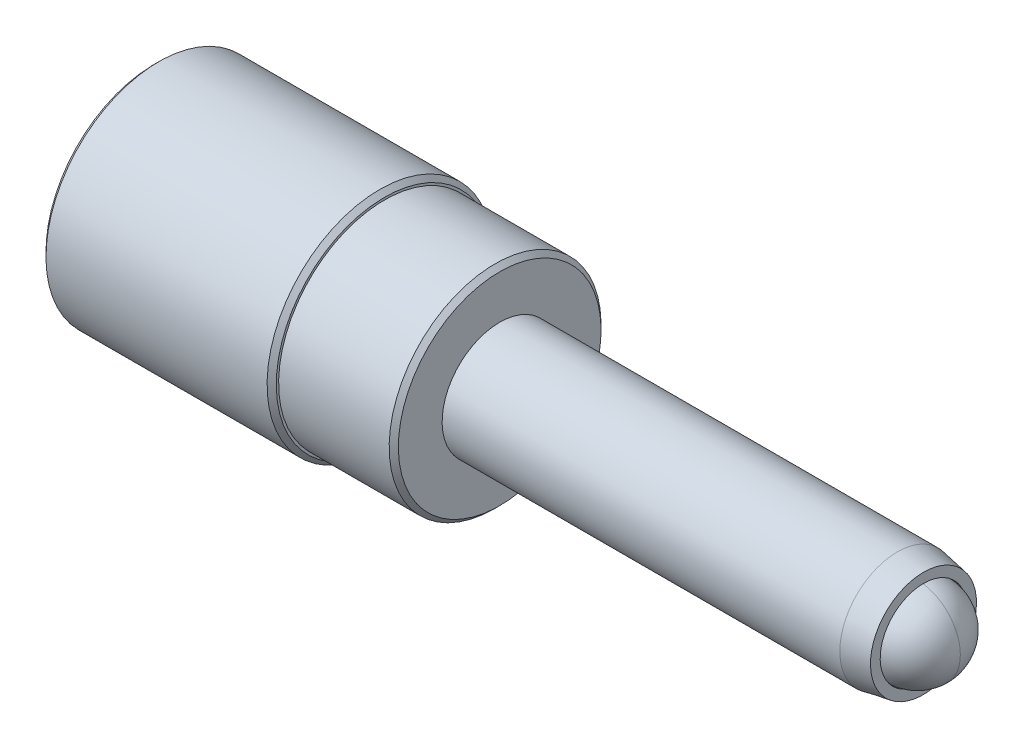
ISO-10303-21;
HEADER;
FILE_DESCRIPTION(('STEP AP214'),'2;1');
FILE_NAME('part.step','',(''),(''),'','','');
FILE_SCHEMA(('AUTOMOTIVE_DESIGN { 1 0 10303 214 1 1 1 1 }'));
ENDSEC;
DATA;
#1=APPLICATION_CONTEXT('core data for automotive mechanical design processes');
#2=APPLICATION_PROTOCOL_DEFINITION('international standard','automotive_design',2000,#1);
#3=PRODUCT_CONTEXT('',#1,'mechanical');
#4=PRODUCT('Part','Part','',(#3));
#5=PRODUCT_RELATED_PRODUCT_CATEGORY('part','',(#4));
#6=PRODUCT_DEFINITION_FORMATION('','',#4);
#7=PRODUCT_DEFINITION_CONTEXT('part definition',#1,'design');
#8=PRODUCT_DEFINITION('design','',#6,#7);
#9=PRODUCT_DEFINITION_SHAPE('','',#8);
#10=(LENGTH_UNIT() NAMED_UNIT(*) SI_UNIT(.MILLI.,.METRE.));
#11=(NAMED_UNIT(*) PLANE_ANGLE_UNIT() SI_UNIT($,.RADIAN.));
#12=(NAMED_UNIT(*) SI_UNIT($,.STERADIAN.) SOLID_ANGLE_UNIT());
#13=UNCERTAINTY_MEASURE_WITH_UNIT(LENGTH_MEASURE(1.E-05),#10,'distance_accuracy_value','');
#14=(GEOMETRIC_REPRESENTATION_CONTEXT(3) GLOBAL_UNCERTAINTY_ASSIGNED_CONTEXT((#13)) GLOBAL_UNIT_ASSIGNED_CONTEXT((#10,
#11,#12)) REPRESENTATION_CONTEXT('',''));
#15=CARTESIAN_POINT('',(0.,0.,0.));
#16=DIRECTION('',(0.,0.,1.));
#17=DIRECTION('',(1.,0.,0.));
#18=AXIS2_PLACEMENT_3D('',#15,#16,#17);
#19=CARTESIAN_POINT('',(-21.246795063286,1.19237132949041,-6.190904680416));
#20=DIRECTION('',(-0.898555667364288,0.394252384271372,0.192776477153873));
#21=DIRECTION('',(-0.186978583481269,-0.741325509164933,0.644573889310365));
#22=AXIS2_PLACEMENT_3D('',#19,#20,#21);
#23=SPHERICAL_SURFACE('',#22,1.190625);
#24=CARTESIAN_POINT('',(-22.3166379047416,1.66177807451351,-5.96138018730467));
#25=VERTEX_POINT('',#24);
#26=VERTEX_LOOP('',#25);
#27=FACE_BOUND('',#26,.T.);
#28=ADVANCED_FACE('P0_F13',(#27),#23,.T.);
#29=CLOSED_SHELL('',(#28));
#30=MANIFOLD_SOLID_BREP('P0_B1',#29);
#31=CARTESIAN_POINT('',(-16.087420063286,1.58320286749358,-2.10278836630096));
#32=DIRECTION('',(-1.,0.,0.));
#33=DIRECTION('',(0.,-1.,0.));
#34=AXIS2_PLACEMENT_3D('',#31,#32,#33);
#35=PLANE('',#34);
#36=CARTESIAN_POINT('',(-16.087420063286,1.58320286749358,-2.10278836630096));
#37=DIRECTION('',(1.,0.,0.));
#38=DIRECTION('',(0.,1.,0.));
#39=AXIS2_PLACEMENT_3D('',#36,#37,#38);
#40=CIRCLE('',#39,2.921);
#41=CARTESIAN_POINT('',(-16.087420063286,4.50420286749358,-2.10278836630096));
#42=VERTEX_POINT('',#41);
#43=EDGE_CURVE('P1_E11',#42,#42,#40,.T.);
#44=ORIENTED_EDGE('',*,*,#43,.F.);
#45=EDGE_LOOP('',(#44));
#46=FACE_BOUND('',#45,.T.);
#47=ADVANCED_FACE('P1_F17',(#46),#35,.T.);
#48=CARTESIAN_POINT('',(-15.833420063286,1.58320286749358,-2.10278836630096));
#49=DIRECTION('',(1.,0.,0.));
#50=DIRECTION('',(0.,1.,0.));
#51=AXIS2_PLACEMENT_3D('',#48,#49,#50);
#52=CONICAL_SURFACE('',#51,3.175,0.785398163397453);
#53=ORIENTED_EDGE('',*,*,#43,.T.);
#54=EDGE_LOOP('',(#53));
#55=FACE_BOUND('',#54,.T.);
#56=CARTESIAN_POINT('',(-15.833420063286,1.58320286749358,-2.10278836630096));
#57=DIRECTION('',(1.,0.,0.));
#58=DIRECTION('',(0.,1.,0.));
#59=AXIS2_PLACEMENT_3D('',#56,#57,#58);
#60=CIRCLE('',#59,3.175);
#61=CARTESIAN_POINT('',(-15.833420063286,4.75820286749359,-2.10278836630096));
#62=VERTEX_POINT('',#61);
#63=EDGE_CURVE('P1_E23',#62,#62,#60,.T.);
#64=ORIENTED_EDGE('',*,*,#63,.F.);
#65=EDGE_LOOP('',(#64));
#66=FACE_BOUND('',#65,.T.);
#67=ADVANCED_FACE('P1_F40',(#55,#66),#52,.T.);
#68=CARTESIAN_POINT('',(16.2637338913131,1.58320286749359,-2.10278836630096));
#69=DIRECTION('',(1.,0.,0.));
#70=DIRECTION('',(0.,1.,0.));
#71=AXIS2_PLACEMENT_3D('',#68,#69,#70);
#72=CYLINDRICAL_SURFACE('',#71,3.175);
#73=ORIENTED_EDGE('',*,*,#63,.T.);
#74=EDGE_LOOP('',(#73));
#75=FACE_BOUND('',#74,.T.);
#76=CARTESIAN_POINT('',(18.5400743545311,1.58320286749359,-2.10278836630096));
#77=DIRECTION('',(1.,0.,0.));
#78=DIRECTION('',(0.,1.,0.));
#79=AXIS2_PLACEMENT_3D('',#76,#77,#78);
#80=CIRCLE('',#79,3.175);
#81=CARTESIAN_POINT('',(18.5400743545311,4.75820286749359,-2.10278836630096));
#82=VERTEX_POINT('',#81);
#83=EDGE_CURVE('P1_E52',#82,#82,#80,.T.);
#84=ORIENTED_EDGE('',*,*,#83,.F.);
#85=EDGE_LOOP('',(#84));
#86=FACE_BOUND('',#85,.T.);
#87=ADVANCED_FACE('P1_F45',(#75,#86),#72,.T.);
#88=CARTESIAN_POINT('',(19.980579936714,1.58320286749359,-2.10278836630096));
#89=DIRECTION('',(-1.,0.,0.));
#90=DIRECTION('',(0.,-1.,0.));
#91=AXIS2_PLACEMENT_3D('',#88,#89,#90);
#92=CONICAL_SURFACE('',#91,2.921,0.174532925199434);
#93=ORIENTED_EDGE('',*,*,#83,.T.);
#94=EDGE_LOOP('',(#93));
#95=FACE_BOUND('',#94,.T.);
#96=CARTESIAN_POINT('',(19.980579936714,1.58320286749359,-2.10278836630096));
#97=DIRECTION('',(1.,0.,0.));
#98=DIRECTION('',(0.,1.,0.));
#99=AXIS2_PLACEMENT_3D('',#96,#97,#98);
#100=CIRCLE('',#99,2.921);
#101=CARTESIAN_POINT('',(19.980579936714,4.50420286749358,-2.10278836630096));
#102=VERTEX_POINT('',#101);
#103=EDGE_CURVE('P1_E54',#102,#102,#100,.T.);
#104=ORIENTED_EDGE('',*,*,#103,.F.);
#105=EDGE_LOOP('',(#104));
#106=FACE_BOUND('',#105,.T.);
#107=ADVANCED_FACE('P1_F68',(#95,#106),#92,.T.);
#108=CARTESIAN_POINT('',(19.980579936714,4.50420286749358,-2.10278836630096));
#109=DIRECTION('',(1.,0.,0.));
#110=DIRECTION('',(0.,1.,0.));
#111=AXIS2_PLACEMENT_3D('',#108,#109,#110);
#112=PLANE('',#111);
#113=ORIENTED_EDGE('',*,*,#103,.T.);
#114=EDGE_LOOP('',(#113));
#115=FACE_BOUND('',#114,.T.);
#116=CARTESIAN_POINT('',(19.980579936714,1.58320286749359,-2.10278836630096));
#117=DIRECTION('',(1.,0.,0.));
#118=DIRECTION('',(0.,1.,0.));
#119=AXIS2_PLACEMENT_3D('',#116,#117,#118);
#120=CIRCLE('',#119,2.3876);
#121=CARTESIAN_POINT('',(19.980579936714,3.97080286749359,-2.10278836630096));
#122=VERTEX_POINT('',#121);
#123=EDGE_CURVE('P1_E59',#122,#122,#120,.T.);
#124=ORIENTED_EDGE('',*,*,#123,.F.);
#125=EDGE_LOOP('',(#124));
#126=FACE_BOUND('',#125,.T.);
#127=ADVANCED_FACE('P1_F35',(#115,#126),#112,.T.);
#128=CARTESIAN_POINT('',(16.2637338913131,1.58320286749359,-2.10278836630096));
#129=DIRECTION('',(1.,0.,0.));
#130=DIRECTION('',(0.,1.,0.));
#131=AXIS2_PLACEMENT_3D('',#128,#129,#130);
#132=CYLINDRICAL_SURFACE('',#131,2.3876);
#133=ORIENTED_EDGE('',*,*,#123,.T.);
#134=EDGE_LOOP('',(#133));
#135=FACE_BOUND('',#134,.T.);
#136=CARTESIAN_POINT('',(18.651333891313,1.58320286749359,-2.10278836630096));
#137=DIRECTION('',(1.,0.,0.));
#138=DIRECTION('',(0.,1.,0.));
#139=AXIS2_PLACEMENT_3D('',#136,#137,#138);
#140=CIRCLE('',#139,2.3876);
#141=CARTESIAN_POINT('',(18.651333891313,3.97080286749359,-2.10278836630096));
#142=VERTEX_POINT('',#141);
#143=EDGE_CURVE('P1_E62',#142,#142,#140,.T.);
#144=ORIENTED_EDGE('',*,*,#143,.F.);
#145=EDGE_LOOP('',(#144));
#146=FACE_BOUND('',#145,.T.);
#147=ADVANCED_FACE('P1_F28',(#135,#146),#132,.F.);
#148=CARTESIAN_POINT('',(16.2637338913131,1.58320286749359,-2.10278836630096));
#149=DIRECTION('',(1.,0.,0.));
#150=DIRECTION('',(0.,1.,0.));
#151=AXIS2_PLACEMENT_3D('',#148,#149,#150);
#152=CONICAL_SURFACE('',#151,0.,0.78539816339745);
#153=ORIENTED_EDGE('',*,*,#143,.T.);
#154=EDGE_LOOP('',(#153));
#155=FACE_BOUND('',#154,.T.);
#156=CARTESIAN_POINT('',(16.2637338913131,1.58320286749359,-2.10278836630096));
#157=VERTEX_POINT('',#156);
#158=VERTEX_LOOP('',#157);
#159=FACE_BOUND('',#158,.T.);
#160=ADVANCED_FACE('P1_F26',(#155,#159),#152,.F.);
#161=CLOSED_SHELL('',(#47,#67,#87,#107,#127,#147,#160));
#162=MANIFOLD_SOLID_BREP('P1_B1',#161);
#163=CARTESIAN_POINT('',(-22.437420063286,1.5832028674936,-2.10278836630096));
#164=DIRECTION('',(-1.,0.,0.));
#165=DIRECTION('',(0.,0.0900550814628505,0.995936786298568));
#166=AXIS2_PLACEMENT_3D('',#163,#164,#165);
#167=PLANE('',#166);
#168=CARTESIAN_POINT('',(-22.437420063286,1.5832028674936,-2.10278836630096));
#169=DIRECTION('',(-1.,0.,0.));
#170=DIRECTION('',(0.,0.0900550814628505,0.995936786298568));
#171=AXIS2_PLACEMENT_3D('',#168,#169,#170);
#172=CIRCLE('',#171,5.96899999999999);
#173=CARTESIAN_POINT('',(-22.437420063286,2.12074164874535,3.84195831111519));
#174=VERTEX_POINT('',#173);
#175=EDGE_CURVE('P2_E30',#174,#174,#172,.T.);
#176=ORIENTED_EDGE('',*,*,#175,.T.);
#177=EDGE_LOOP('',(#176));
#178=FACE_BOUND('',#177,.T.);
#179=CARTESIAN_POINT('',(-22.437420063286,1.21721901642857,-6.15027546581834));
#180=DIRECTION('',(-1.,0.,0.));
#181=DIRECTION('',(0.,0.0900550814628505,0.995936786298568));
#182=AXIS2_PLACEMENT_3D('',#179,#180,#181);
#183=CIRCLE('',#182,1.143);
#184=CARTESIAN_POINT('',(-22.437420063286,1.32015197454061,-5.01191971907907));
#185=VERTEX_POINT('',#184);
#186=EDGE_CURVE('P2_E57',#185,#185,#183,.T.);
#187=ORIENTED_EDGE('',*,*,#186,.F.);
#188=EDGE_LOOP('',(#187));
#189=FACE_BOUND('',#188,.T.);
#190=ADVANCED_FACE('P2_F15',(#178,#189),#167,.T.);
#191=CARTESIAN_POINT('',(-3.38742006328601,1.58320286749359,-2.10278836630096));
#192=DIRECTION('',(1.,0.,0.));
#193=DIRECTION('',(0.,-0.0900550814628505,-0.995936786298568));
#194=AXIS2_PLACEMENT_3D('',#191,#192,#193);
#195=CYLINDRICAL_SURFACE('',#194,6.223);
#196=CARTESIAN_POINT('',(-22.183420063286,1.5832028674936,-2.10278836630096));
#197=DIRECTION('',(-1.,0.,0.));
#198=DIRECTION('',(0.,0.0900550814628505,0.995936786298568));
#199=AXIS2_PLACEMENT_3D('',#196,#197,#198);
#200=CIRCLE('',#199,6.223);
#201=CARTESIAN_POINT('',(-22.183420063286,2.14361563943691,4.09492625483503));
#202=VERTEX_POINT('',#201);
#203=EDGE_CURVE('P2_E35',#202,#202,#200,.F.);
#204=ORIENTED_EDGE('',*,*,#203,.T.);
#205=EDGE_LOOP('',(#204));
#206=FACE_BOUND('',#205,.T.);
#207=CARTESIAN_POINT('',(-9.99142006328602,1.58320286749359,-2.10278836630096));
#208=DIRECTION('',(1.,0.,0.));
#209=DIRECTION('',(0.,-0.0900550814628505,-0.995936786298568));
#210=AXIS2_PLACEMENT_3D('',#207,#208,#209);
#211=CIRCLE('',#210,6.223);
#212=CARTESIAN_POINT('',(-9.99142006328602,1.02279009555028,-8.30050298743694));
#213=VERTEX_POINT('',#212);
#214=EDGE_CURVE('P2_E38',#213,#213,#211,.F.);
#215=ORIENTED_EDGE('',*,*,#214,.T.);
#216=EDGE_LOOP('',(#215));
#217=FACE_BOUND('',#216,.T.);
#218=ADVANCED_FACE('P2_F73',(#206,#217),#195,.T.);
#219=CARTESIAN_POINT('',(-9.73742006328602,1.02279009555028,-8.30050298743694));
#220=DIRECTION('',(1.,0.,0.));
#221=DIRECTION('',(0.,-0.0900550814628505,-0.995936786298568));
#222=AXIS2_PLACEMENT_3D('',#219,#220,#221);
#223=PLANE('',#222);
#224=CARTESIAN_POINT('',(-9.73742006328601,1.58320286749359,-2.10278836630096));
#225=DIRECTION('',(1.,0.,0.));
#226=DIRECTION('',(0.,-0.0900550814628505,-0.995936786298568));
#227=AXIS2_PLACEMENT_3D('',#224,#225,#226);
#228=CIRCLE('',#227,5.969);
#229=CARTESIAN_POINT('',(-9.73742006328601,1.04566408624184,-8.0475350437171));
#230=VERTEX_POINT('',#229);
#231=EDGE_CURVE('P2_E10',#230,#230,#228,.T.);
#232=ORIENTED_EDGE('',*,*,#231,.T.);
#233=EDGE_LOOP('',(#232));
#234=FACE_BOUND('',#233,.T.);
#235=CARTESIAN_POINT('',(-9.73742006328601,1.58320286749359,-2.10278836630096));
#236=DIRECTION('',(1.,0.,0.));
#237=DIRECTION('',(0.,-0.0900550814628505,-0.995936786298568));
#238=AXIS2_PLACEMENT_3D('',#235,#236,#237);
#239=CIRCLE('',#238,5.842);
#240=CARTESIAN_POINT('',(-9.73742006328601,1.05710108158762,-7.92105107185719));
#241=VERTEX_POINT('',#240);
#242=EDGE_CURVE('P2_E41',#241,#241,#239,.T.);
#243=ORIENTED_EDGE('',*,*,#242,.F.);
#244=EDGE_LOOP('',(#243));
#245=FACE_BOUND('',#244,.T.);
#246=ADVANCED_FACE('P2_F80',(#234,#245),#223,.T.);
#247=CARTESIAN_POINT('',(-3.38742006328601,1.58320286749359,-2.10278836630096));
#248=DIRECTION('',(1.,0.,0.));
#249=DIRECTION('',(0.,-0.0900550814628505,-0.995936786298568));
#250=AXIS2_PLACEMENT_3D('',#247,#248,#249);
#251=CYLINDRICAL_SURFACE('',#250,5.842);
#252=CARTESIAN_POINT('',(-3.64142006328601,1.58320286749359,-2.10278836630096));
#253=DIRECTION('',(1.,0.,0.));
#254=DIRECTION('',(0.,-0.0900550814628505,-0.995936786298568));
#255=AXIS2_PLACEMENT_3D('',#252,#253,#254);
#256=CIRCLE('',#255,5.842);
#257=CARTESIAN_POINT('',(-3.64142006328601,1.05710108158762,-7.92105107185719));
#258=VERTEX_POINT('',#257);
#259=EDGE_CURVE('P2_E22',#258,#258,#256,.F.);
#260=ORIENTED_EDGE('',*,*,#259,.T.);
#261=EDGE_LOOP('',(#260));
#262=FACE_BOUND('',#261,.T.);
#263=ORIENTED_EDGE('',*,*,#242,.T.);
#264=EDGE_LOOP('',(#263));
#265=FACE_BOUND('',#264,.T.);
#266=ADVANCED_FACE('P2_F102',(#262,#265),#251,.T.);
#267=CARTESIAN_POINT('',(-3.38742006328601,1.05710108158762,-7.92105107185719));
#268=DIRECTION('',(1.,0.,0.));
#269=DIRECTION('',(0.,-0.0900550814628505,-0.995936786298568));
#270=AXIS2_PLACEMENT_3D('',#267,#268,#269);
#271=PLANE('',#270);
#272=CARTESIAN_POINT('',(-3.38742006328601,1.58320286749359,-2.10278836630096));
#273=DIRECTION('',(1.,0.,0.));
#274=DIRECTION('',(0.,-0.0900550814628505,-0.995936786298568));
#275=AXIS2_PLACEMENT_3D('',#272,#273,#274);
#276=CIRCLE('',#275,5.588);
#277=CARTESIAN_POINT('',(-3.38742006328601,1.07997507227918,-7.66808312813736));
#278=VERTEX_POINT('',#277);
#279=EDGE_CURVE('P2_E26',#278,#278,#276,.T.);
#280=ORIENTED_EDGE('',*,*,#279,.T.);
#281=EDGE_LOOP('',(#280));
#282=FACE_BOUND('',#281,.T.);
#283=CARTESIAN_POINT('',(-3.38742006328601,1.58320286749359,-2.10278836630096));
#284=DIRECTION('',(1.,0.,0.));
#285=DIRECTION('',(0.,-0.0900550814628505,-0.995936786298568));
#286=AXIS2_PLACEMENT_3D('',#283,#284,#285);
#287=CIRCLE('',#286,3.1496);
#288=CARTESIAN_POINT('',(-3.38742006328601,1.2995653829182,-5.23959086842693));
#289=VERTEX_POINT('',#288);
#290=EDGE_CURVE('P2_E51',#289,#289,#287,.T.);
#291=ORIENTED_EDGE('',*,*,#290,.F.);
#292=EDGE_LOOP('',(#291));
#293=FACE_BOUND('',#292,.T.);
#294=ADVANCED_FACE('P2_F98',(#282,#293),#271,.T.);
#295=CARTESIAN_POINT('',(-9.48342006328602,1.58320286749359,-2.10278836630096));
#296=DIRECTION('',(1.,0.,0.));
#297=DIRECTION('',(0.,-0.0900550814628505,-0.995936786298568));
#298=AXIS2_PLACEMENT_3D('',#295,#296,#297);
#299=PLANE('',#298);
#300=CARTESIAN_POINT('',(-9.48342006328602,1.58320286749359,-2.10278836630096));
#301=DIRECTION('',(1.,0.,0.));
#302=DIRECTION('',(0.,-0.0900550814628505,-0.995936786298568));
#303=AXIS2_PLACEMENT_3D('',#300,#301,#302);
#304=CIRCLE('',#303,3.1496);
#305=CARTESIAN_POINT('',(-9.48342006328602,1.2995653829182,-5.23959086842693));
#306=VERTEX_POINT('',#305);
#307=EDGE_CURVE('P2_E46',#306,#306,#304,.T.);
#308=ORIENTED_EDGE('',*,*,#307,.T.);
#309=EDGE_LOOP('',(#308));
#310=FACE_BOUND('',#309,.T.);
#311=CARTESIAN_POINT('',(-9.48342006328602,1.58320286749359,-2.10278836630096));
#312=DIRECTION('',(1.,0.,0.));
#313=DIRECTION('',(0.,-0.0900550814628505,-0.995936786298568));
#314=AXIS2_PLACEMENT_3D('',#311,#312,#313);
#315=CIRCLE('',#314,2.9718);
#316=CARTESIAN_POINT('',(-9.48342006328602,1.31557717640229,-5.06251330782304));
#317=VERTEX_POINT('',#316);
#318=EDGE_CURVE('P2_E42',#317,#317,#315,.F.);
#319=ORIENTED_EDGE('',*,*,#318,.T.);
#320=EDGE_LOOP('',(#319));
#321=FACE_BOUND('',#320,.T.);
#322=ADVANCED_FACE('P2_F101',(#310,#321),#299,.T.);
#323=CARTESIAN_POINT('',(-9.48342006328602,1.58320286749359,-2.10278836630096));
#324=DIRECTION('',(1.,0.,0.));
#325=DIRECTION('',(0.,-0.0900550814628505,-0.995936786298568));
#326=AXIS2_PLACEMENT_3D('',#323,#324,#325);
#327=CYLINDRICAL_SURFACE('',#326,3.1496);
#328=ORIENTED_EDGE('',*,*,#307,.F.);
#329=EDGE_LOOP('',(#328));
#330=FACE_BOUND('',#329,.T.);
#331=ORIENTED_EDGE('',*,*,#290,.T.);
#332=EDGE_LOOP('',(#331));
#333=FACE_BOUND('',#332,.T.);
#334=ADVANCED_FACE('P2_F106',(#330,#333),#327,.F.);
#335=CARTESIAN_POINT('',(-16.087420063286,1.58320286749359,-2.10278836630096));
#336=DIRECTION('',(1.,0.,0.));
#337=DIRECTION('',(0.,-0.0900550814628505,-0.995936786298568));
#338=AXIS2_PLACEMENT_3D('',#335,#336,#337);
#339=PLANE('',#338);
#340=CARTESIAN_POINT('',(-16.087420063286,1.58320286749359,-2.10278836630096));
#341=DIRECTION('',(1.,0.,0.));
#342=DIRECTION('',(0.,-0.0900550814628505,-0.995936786298568));
#343=AXIS2_PLACEMENT_3D('',#340,#341,#342);
#344=CIRCLE('',#343,2.9718);
#345=CARTESIAN_POINT('',(-16.087420063286,1.3155771764023,-5.06251330782304));
#346=VERTEX_POINT('',#345);
#347=EDGE_CURVE('P2_E45',#346,#346,#344,.T.);
#348=ORIENTED_EDGE('',*,*,#347,.T.);
#349=EDGE_LOOP('',(#348));
#350=FACE_BOUND('',#349,.T.);
#351=ADVANCED_FACE('P2_F108',(#350),#339,.T.);
#352=CARTESIAN_POINT('',(-16.087420063286,1.58320286749359,-2.10278836630096));
#353=DIRECTION('',(1.,0.,0.));
#354=DIRECTION('',(0.,-0.0900550814628505,-0.995936786298568));
#355=AXIS2_PLACEMENT_3D('',#352,#353,#354);
#356=CYLINDRICAL_SURFACE('',#355,2.9718);
#357=ORIENTED_EDGE('',*,*,#347,.F.);
#358=EDGE_LOOP('',(#357));
#359=FACE_BOUND('',#358,.T.);
#360=ORIENTED_EDGE('',*,*,#318,.F.);
#361=EDGE_LOOP('',(#360));
#362=FACE_BOUND('',#361,.T.);
#363=ADVANCED_FACE('P2_F68',(#359,#362),#356,.F.);
#364=CARTESIAN_POINT('',(-20.151420063286,1.21721901642857,-6.15027546581834));
#365=DIRECTION('',(-1.,0.,0.));
#366=DIRECTION('',(0.,0.0900550814628505,0.995936786298568));
#367=AXIS2_PLACEMENT_3D('',#364,#365,#366);
#368=CYLINDRICAL_SURFACE('',#367,1.143);
#369=CARTESIAN_POINT('',(-20.151420063286,1.21721901642857,-6.15027546581834));
#370=DIRECTION('',(-1.,0.,0.));
#371=DIRECTION('',(0.,0.0900550814628505,0.995936786298568));
#372=AXIS2_PLACEMENT_3D('',#369,#370,#371);
#373=CIRCLE('',#372,1.143);
#374=CARTESIAN_POINT('',(-20.151420063286,1.32015197454061,-5.01191971907907));
#375=VERTEX_POINT('',#374);
#376=EDGE_CURVE('P2_E54',#375,#375,#373,.T.);
#377=ORIENTED_EDGE('',*,*,#376,.F.);
#378=EDGE_LOOP('',(#377));
#379=FACE_BOUND('',#378,.T.);
#380=ORIENTED_EDGE('',*,*,#186,.T.);
#381=EDGE_LOOP('',(#380));
#382=FACE_BOUND('',#381,.T.);
#383=ADVANCED_FACE('P2_F65',(#379,#382),#368,.F.);
#384=CARTESIAN_POINT('',(-20.151420063286,1.21721901642857,-6.15027546581834));
#385=DIRECTION('',(-1.,0.,0.));
#386=DIRECTION('',(0.,0.0900550814628505,0.995936786298568));
#387=AXIS2_PLACEMENT_3D('',#384,#385,#386);
#388=PLANE('',#387);
#389=ORIENTED_EDGE('',*,*,#376,.T.);
#390=EDGE_LOOP('',(#389));
#391=FACE_BOUND('',#390,.T.);
#392=ADVANCED_FACE('P2_F63',(#391),#388,.T.);
#393=CARTESIAN_POINT('',(-22.183420063286,1.5832028674936,-2.10278836630096));
#394=DIRECTION('',(1.,0.,0.));
#395=DIRECTION('',(0.,-0.0900550814628505,-0.995936786298568));
#396=AXIS2_PLACEMENT_3D('',#393,#394,#395);
#397=CONICAL_SURFACE('',#396,6.223,0.78539816339745);
#398=ORIENTED_EDGE('',*,*,#175,.F.);
#399=EDGE_LOOP('',(#398));
#400=FACE_BOUND('',#399,.T.);
#401=ORIENTED_EDGE('',*,*,#203,.F.);
#402=EDGE_LOOP('',(#401));
#403=FACE_BOUND('',#402,.T.);
#404=ADVANCED_FACE('P2_F85',(#400,#403),#397,.T.);
#405=CARTESIAN_POINT('',(-3.38742006328601,1.58320286749359,-2.10278836630096));
#406=DIRECTION('',(-1.,0.,0.));
#407=DIRECTION('',(0.,0.0900550814628505,0.995936786298568));
#408=AXIS2_PLACEMENT_3D('',#405,#406,#407);
#409=CONICAL_SURFACE('',#408,5.588,0.785398163397443);
#410=ORIENTED_EDGE('',*,*,#259,.F.);
#411=EDGE_LOOP('',(#410));
#412=FACE_BOUND('',#411,.T.);
#413=ORIENTED_EDGE('',*,*,#279,.F.);
#414=EDGE_LOOP('',(#413));
#415=FACE_BOUND('',#414,.T.);
#416=ADVANCED_FACE('P2_F87',(#412,#415),#409,.T.);
#417=CARTESIAN_POINT('',(-9.73742006328601,1.58320286749359,-2.10278836630096));
#418=DIRECTION('',(-1.,0.,0.));
#419=DIRECTION('',(0.,0.0900550814628505,0.995936786298568));
#420=AXIS2_PLACEMENT_3D('',#417,#418,#419);
#421=CONICAL_SURFACE('',#420,5.969,0.785398163397447);
#422=ORIENTED_EDGE('',*,*,#214,.F.);
#423=EDGE_LOOP('',(#422));
#424=FACE_BOUND('',#423,.T.);
#425=ORIENTED_EDGE('',*,*,#231,.F.);
#426=EDGE_LOOP('',(#425));
#427=FACE_BOUND('',#426,.T.);
#428=ADVANCED_FACE('P2_F17',(#424,#427),#421,.T.);
#429=CLOSED_SHELL('',(#190,#218,#246,#266,#294,#322,#334,#351,#363,#383,#392,#404,#416,#428));
#430=MANIFOLD_SOLID_BREP('P2_B1',#429);
#431=CARTESIAN_POINT('',(19.631329936714,1.58320286749359,-2.10278836630096));
#432=DIRECTION('',(-1.,0.,0.));
#433=DIRECTION('',(0.,1.,0.));
#434=AXIS2_PLACEMENT_3D('',#431,#432,#433);
#435=SPHERICAL_SURFACE('',#434,2.38125);
#436=CARTESIAN_POINT('',(19.631329936714,1.58320286749359,-2.10278836630096));
#437=DIRECTION('',(0.,0.,1.));
#438=DIRECTION('',(0.,1.,0.));
#439=AXIS2_PLACEMENT_3D('',#436,#437,#438);
#440=CIRCLE('',#439,2.38125);
#441=CARTESIAN_POINT('',(19.631329936714,3.96445286749359,-2.10278836630096));
#442=VERTEX_POINT('',#441);
#443=CARTESIAN_POINT('',(19.631329936714,-0.79804713250641,-2.10278836630096));
#444=VERTEX_POINT('',#443);
#445=EDGE_CURVE('P3_E33',#442,#444,#440,.T.);
#446=ORIENTED_EDGE('',*,*,#445,.T.);
#447=CARTESIAN_POINT('',(19.631329936714,1.58320286749359,-2.10278836630096));
#448=DIRECTION('',(-1.,0.,0.));
#449=DIRECTION('',(0.,0.,1.));
#450=AXIS2_PLACEMENT_3D('',#447,#448,#449);
#451=CIRCLE('',#450,2.38125);
#452=EDGE_CURVE('P3_E10',#444,#442,#451,.T.);
#453=ORIENTED_EDGE('',*,*,#452,.T.);
#454=EDGE_LOOP('',(#446,#453));
#455=FACE_BOUND('',#454,.T.);
#456=ADVANCED_FACE('P3_F16',(#455),#435,.T.);
#457=ORIENTED_EDGE('',*,*,#445,.F.);
#458=CARTESIAN_POINT('',(19.631329936714,1.58320286749359,-2.10278836630096));
#459=DIRECTION('',(-1.,0.,0.));
#460=DIRECTION('',(0.,0.,1.));
#461=AXIS2_PLACEMENT_3D('',#458,#459,#460);
#462=CIRCLE('',#461,2.38125);
#463=EDGE_CURVE('P3_E23',#442,#444,#462,.T.);
#464=ORIENTED_EDGE('',*,*,#463,.T.);
#465=EDGE_LOOP('',(#457,#464));
#466=FACE_BOUND('',#465,.T.);
#467=ADVANCED_FACE('P3_F40',(#466),#435,.T.);
#468=ORIENTED_EDGE('',*,*,#452,.F.);
#469=EDGE_CURVE('P3_E36',#444,#442,#440,.T.);
#470=ORIENTED_EDGE('',*,*,#469,.T.);
#471=EDGE_LOOP('',(#468,#470));
#472=FACE_BOUND('',#471,.T.);
#473=ADVANCED_FACE('P3_F38',(#472),#435,.T.);
#474=ORIENTED_EDGE('',*,*,#463,.F.);
#475=ORIENTED_EDGE('',*,*,#469,.F.);
#476=EDGE_LOOP('',(#474,#475));
#477=FACE_BOUND('',#476,.T.);
#478=ADVANCED_FACE('P3_F18',(#477),#435,.T.);
#479=CLOSED_SHELL('',(#456,#467,#473,#478));
#480=MANIFOLD_SOLID_BREP('P3_B1',#479);
#481=ADVANCED_BREP_SHAPE_REPRESENTATION('',(#18,#30,#162,#430,#480),#14);
#482=SHAPE_DEFINITION_REPRESENTATION(#9,#481);
ENDSEC;
END-ISO-10303-21;
